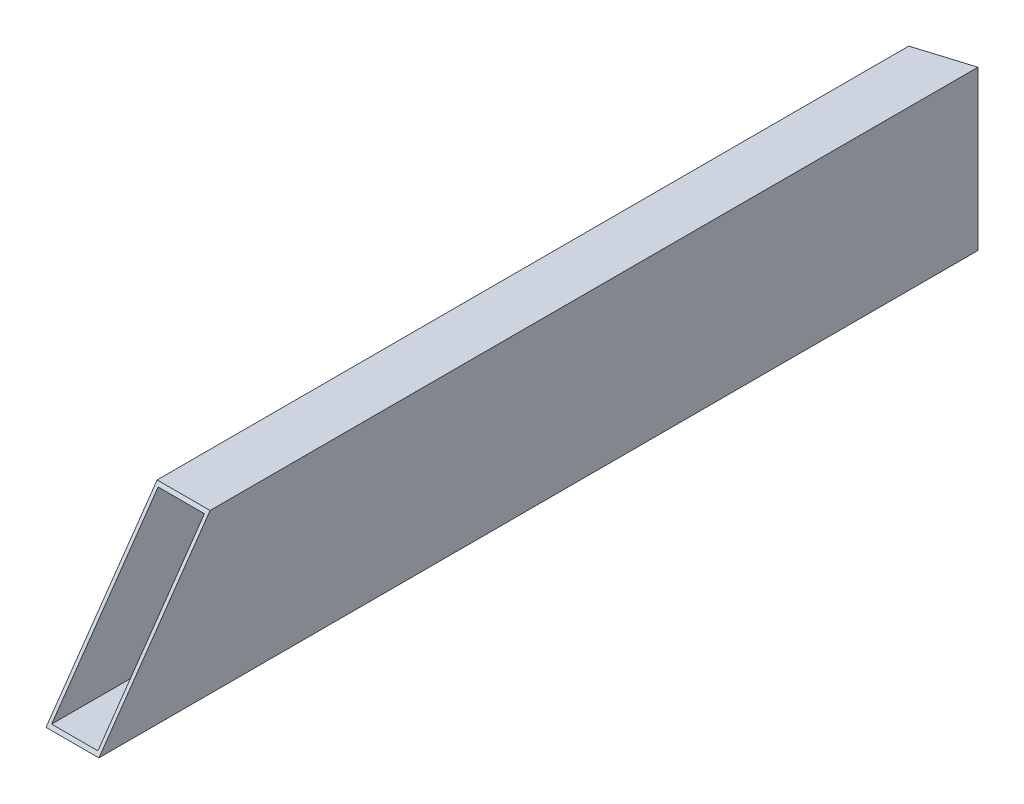
ISO-10303-21;
HEADER;
FILE_DESCRIPTION(('STEP AP214'),'2;1');
FILE_NAME('part.step','',(''),(''),'','','');
FILE_SCHEMA(('AUTOMOTIVE_DESIGN { 1 0 10303 214 1 1 1 1 }'));
ENDSEC;
DATA;
#1=APPLICATION_CONTEXT('core data for automotive mechanical design processes');
#2=APPLICATION_PROTOCOL_DEFINITION('international standard','automotive_design',2000,#1);
#3=PRODUCT_CONTEXT('',#1,'mechanical');
#4=PRODUCT('Part','Part','',(#3));
#5=PRODUCT_RELATED_PRODUCT_CATEGORY('part','',(#4));
#6=PRODUCT_DEFINITION_FORMATION('','',#4);
#7=PRODUCT_DEFINITION_CONTEXT('part definition',#1,'design');
#8=PRODUCT_DEFINITION('design','',#6,#7);
#9=PRODUCT_DEFINITION_SHAPE('','',#8);
#10=(LENGTH_UNIT() NAMED_UNIT(*) SI_UNIT(.MILLI.,.METRE.));
#11=(NAMED_UNIT(*) PLANE_ANGLE_UNIT() SI_UNIT($,.RADIAN.));
#12=(NAMED_UNIT(*) SI_UNIT($,.STERADIAN.) SOLID_ANGLE_UNIT());
#13=UNCERTAINTY_MEASURE_WITH_UNIT(LENGTH_MEASURE(1.E-05),#10,'distance_accuracy_value','');
#14=(GEOMETRIC_REPRESENTATION_CONTEXT(3) GLOBAL_UNCERTAINTY_ASSIGNED_CONTEXT((#13)) GLOBAL_UNIT_ASSIGNED_CONTEXT((#10,
#11,#12)) REPRESENTATION_CONTEXT('',''));
#15=CARTESIAN_POINT('',(0.,0.,0.));
#16=DIRECTION('',(0.,0.,1.));
#17=DIRECTION('',(1.,0.,0.));
#18=AXIS2_PLACEMENT_3D('',#15,#16,#17);
#19=CARTESIAN_POINT('',(165.398672692201,38.1004421670406,222.495695070807));
#20=DIRECTION('',(-0.999999999393182,-3.48372726175517E-05,3.93623097224433E-09));
#21=DIRECTION('',(3.48372726175514E-05,-0.999999999393182,0.));
#22=AXIS2_PLACEMENT_3D('',#19,#20,#21);
#23=PLANE('',#22);
#24=DIRECTION('',(3.48372707337596E-05,-0.999999971842059,-0.000234738672888281));
#25=VECTOR('',#24,1.);
#26=CARTESIAN_POINT('',(165.398667903435,38.1932372043687,-172.816392793576));
#27=LINE('',#26,#25);
#28=CARTESIAN_POINT('',(165.398672692199,38.0557762631937,-172.816425060976));
#29=VERTEX_POINT('',#28);
#30=CARTESIAN_POINT('',(165.40132729239,-38.1442261980139,-172.834312148931));
#31=VERTEX_POINT('',#30);
#32=EDGE_CURVE('E141',#29,#31,#27,.T.);
#33=ORIENTED_EDGE('',*,*,#32,.F.);
#34=DIRECTION('',(0.,-0.000112988955529244,-0.999999993616748));
#35=VECTOR('',#34,1.);
#36=CARTESIAN_POINT('',(165.398672692201,38.1004421670406,222.495695070807));
#37=LINE('',#36,#35);
#38=CARTESIAN_POINT('',(165.398672692201,38.0974281855995,195.820685927171));
#39=VERTEX_POINT('',#38);
#40=EDGE_CURVE('E182',#39,#29,#37,.T.);
#41=ORIENTED_EDGE('',*,*,#40,.F.);
#42=DIRECTION('',(-2.85381520902228E-05,0.81911963874694,-0.573622712769166));
#43=VECTOR('',#42,1.);
#44=CARTESIAN_POINT('',(165.399109295172,25.5657804806881,204.596495237463));
#45=LINE('',#44,#43);
#46=CARTESIAN_POINT('',(165.401327292399,-38.0965433888734,249.178694456995));
#47=VERTEX_POINT('',#46);
#48=EDGE_CURVE('E130',#47,#39,#45,.T.);
#49=ORIENTED_EDGE('',*,*,#48,.F.);
#50=DIRECTION('',(0.,-0.000112988955529244,-0.999999993616748));
#51=VECTOR('',#50,1.);
#52=CARTESIAN_POINT('',(165.401327292391,-38.099557300316,222.504304829213));
#53=LINE('',#52,#51);
#54=EDGE_CURVE('E46',#47,#31,#53,.T.);
#55=ORIENTED_EDGE('',*,*,#54,.T.);
#56=EDGE_LOOP('',(#33,#41,#49,#55));
#57=FACE_BOUND('',#56,.T.);
#58=ADVANCED_FACE('F42',(#57),#23,.F.);
#59=CARTESIAN_POINT('',(139.998672707614,38.0995573003161,222.495695170787));
#60=DIRECTION('',(3.48372728377043E-05,-0.99999999300993,0.000112988955460712));
#61=DIRECTION('',(0.,-0.000112988955529249,-0.999999993616748));
#62=AXIS2_PLACEMENT_3D('',#59,#60,#61);
#63=PLANE('',#62);
#64=DIRECTION('',(0.955609018626309,5.3557652019906E-13,-0.294637749652117));
#65=VECTOR('',#64,1.);
#66=CARTESIAN_POINT('',(30.9001983901309,38.0557762631183,-131.347239413304));
#67=LINE('',#66,#65);
#68=CARTESIAN_POINT('',(139.998672707612,38.0557762631795,-164.984980724692));
#69=VERTEX_POINT('',#68);
#70=EDGE_CURVE('E136',#69,#29,#67,.T.);
#71=ORIENTED_EDGE('',*,*,#70,.F.);
#72=DIRECTION('',(0.,-0.000112988955529244,-0.999999993616748));
#73=VECTOR('',#72,1.);
#74=CARTESIAN_POINT('',(139.998672707614,38.0995573003161,222.495695170787));
#75=LINE('',#74,#73);
#76=CARTESIAN_POINT('',(139.998672707614,38.0965433888735,195.821305543005));
#77=VERTEX_POINT('',#76);
#78=EDGE_CURVE('E180',#77,#69,#75,.T.);
#79=ORIENTED_EDGE('',*,*,#78,.F.);
#80=DIRECTION('',(-0.999999999095737,-3.48345167604918E-05,2.43943241643697E-05));
#81=VECTOR('',#80,1.);
#82=CARTESIAN_POINT('',(139.998022108895,38.0965433662102,195.821305558876));
#83=LINE('',#82,#81);
#84=EDGE_CURVE('E134',#39,#77,#83,.T.);
#85=ORIENTED_EDGE('',*,*,#84,.F.);
#86=ORIENTED_EDGE('',*,*,#40,.T.);
#87=EDGE_LOOP('',(#71,#79,#85,#86));
#88=FACE_BOUND('',#87,.T.);
#89=ADVANCED_FACE('F190',(#88),#63,.F.);
#90=CARTESIAN_POINT('',(139.998672707614,38.0995573003161,222.495695170787));
#91=DIRECTION('',(0.999999999393182,3.48372726175517E-05,-3.93623097224433E-09));
#92=DIRECTION('',(-3.48372726175514E-05,0.999999999393182,0.));
#93=AXIS2_PLACEMENT_3D('',#90,#91,#92);
#94=PLANE('',#93);
#95=DIRECTION('',(-3.48372707337596E-05,0.999999971842059,0.000234738672888281));
#96=VECTOR('',#95,1.);
#97=CARTESIAN_POINT('',(139.998668013717,38.190513994919,-164.984949096535));
#98=LINE('',#97,#96);
#99=CARTESIAN_POINT('',(140.001327307795,-38.1442261980283,-165.002867812645));
#100=VERTEX_POINT('',#99);
#101=EDGE_CURVE('E11',#100,#69,#98,.T.);
#102=ORIENTED_EDGE('',*,*,#101,.F.);
#103=DIRECTION('',(0.,-0.000112988955529244,-0.999999993616748));
#104=VECTOR('',#103,1.);
#105=CARTESIAN_POINT('',(140.001327307804,-38.1004421670406,222.504304929193));
#106=LINE('',#105,#104);
#107=CARTESIAN_POINT('',(140.001327307804,-38.0974281855995,249.179314072829));
#108=VERTEX_POINT('',#107);
#109=EDGE_CURVE('E110',#108,#100,#106,.T.);
#110=ORIENTED_EDGE('',*,*,#109,.F.);
#111=DIRECTION('',(2.85381520902228E-05,-0.81911963874694,0.573622712769166));
#112=VECTOR('',#111,1.);
#113=CARTESIAN_POINT('',(139.999109300445,25.5651867262026,204.596911038822));
#114=LINE('',#113,#112);
#115=EDGE_CURVE('E115',#77,#108,#114,.T.);
#116=ORIENTED_EDGE('',*,*,#115,.F.);
#117=ORIENTED_EDGE('',*,*,#78,.T.);
#118=EDGE_LOOP('',(#102,#110,#116,#117));
#119=FACE_BOUND('',#118,.T.);
#120=ADVANCED_FACE('F112',(#119),#94,.F.);
#121=CARTESIAN_POINT('',(163.811227997335,36.5128868739671,222.495874447022));
#122=DIRECTION('',(-0.999999999393182,-3.48372726173296E-05,3.93623097224433E-09));
#123=DIRECTION('',(3.48372726173294E-05,-0.999999999393182,0.));
#124=AXIS2_PLACEMENT_3D('',#121,#122,#123);
#125=PLANE('',#124);
#126=DIRECTION('',(0.,-0.000112988955529244,-0.999999993616748));
#127=VECTOR('',#126,1.);
#128=CARTESIAN_POINT('',(163.811227997335,36.5128868739671,222.495874447022));
#129=LINE('',#128,#127);
#130=CARTESIAN_POINT('',(163.811227997343,36.5099984780026,196.932349830865));
#131=VERTEX_POINT('',#130);
#132=CARTESIAN_POINT('',(163.811227997333,36.4682762119177,-172.327332437624));
#133=VERTEX_POINT('',#132);
#134=EDGE_CURVE('E158',#131,#133,#129,.T.);
#135=ORIENTED_EDGE('',*,*,#134,.T.);
#136=DIRECTION('',(3.48372707335376E-05,-0.999999971842059,-0.000234738672888212));
#137=VECTOR('',#136,1.);
#138=CARTESIAN_POINT('',(163.811223214492,36.6055671444547,-172.327300210132));
#139=LINE('',#138,#137);
#140=CARTESIAN_POINT('',(163.813771989192,-36.5567261467398,-172.344474230251));
#141=VERTEX_POINT('',#140);
#142=EDGE_CURVE('E77',#133,#141,#139,.T.);
#143=ORIENTED_EDGE('',*,*,#142,.T.);
#144=DIRECTION('',(0.,-0.000112988955529244,-0.999999993616748));
#145=VECTOR('',#144,1.);
#146=CARTESIAN_POINT('',(163.813771989184,-36.5121126155832,222.504125465495));
#147=LINE('',#146,#145);
#148=CARTESIAN_POINT('',(163.813771989192,-36.5092242808674,248.06710800528));
#149=VERTEX_POINT('',#148);
#150=EDGE_CURVE('E162',#149,#141,#147,.T.);
#151=ORIENTED_EDGE('',*,*,#150,.F.);
#152=DIRECTION('',(-2.85381520900409E-05,0.81911963874694,-0.573622712769166));
#153=VECTOR('',#152,1.);
#154=CARTESIAN_POINT('',(163.811646408093,24.5005148875559,205.342491927625));
#155=LINE('',#154,#153);
#156=EDGE_CURVE('E157',#149,#131,#155,.T.);
#157=ORIENTED_EDGE('',*,*,#156,.T.);
#158=EDGE_LOOP('',(#135,#143,#151,#157));
#159=FACE_BOUND('',#158,.T.);
#160=ADVANCED_FACE('F211',(#159),#125,.T.);
#161=CARTESIAN_POINT('',(141.58877200267,-36.512886873967,222.504125552978));
#162=DIRECTION('',(-3.48372728368161E-05,0.99999999300993,-0.000112988955460711));
#163=DIRECTION('',(0.,0.000112988955529249,0.999999993616748));
#164=AXIS2_PLACEMENT_3D('',#161,#162,#163);
#165=PLANE('',#164);
#166=ORIENTED_EDGE('',*,*,#150,.T.);
#167=DIRECTION('',(-0.955609018626309,-5.34729107781046E-13,0.294637749652117));
#168=VECTOR('',#167,1.);
#169=CARTESIAN_POINT('',(32.3451795971214,-36.5567261468133,-131.809475651006));
#170=LINE('',#169,#168);
#171=CARTESIAN_POINT('',(141.588772002669,-36.5567261467522,-165.491960436));
#172=VERTEX_POINT('',#171);
#173=EDGE_CURVE('E62',#141,#172,#170,.T.);
#174=ORIENTED_EDGE('',*,*,#173,.T.);
#175=DIRECTION('',(0.,-0.000112988955529244,-0.999999993616748));
#176=VECTOR('',#175,1.);
#177=CARTESIAN_POINT('',(141.58877200267,-36.512886873967,222.504125552978));
#178=LINE('',#177,#176);
#179=CARTESIAN_POINT('',(141.588772002671,-36.5099984780026,248.067650169135));
#180=VERTEX_POINT('',#179);
#181=EDGE_CURVE('E167',#180,#172,#178,.T.);
#182=ORIENTED_EDGE('',*,*,#181,.F.);
#183=DIRECTION('',(0.999999999095737,3.48345167596037E-05,-2.43943241637476E-05));
#184=VECTOR('',#183,1.);
#185=CARTESIAN_POINT('',(141.58939550696,-36.5099984562831,248.067650153925));
#186=LINE('',#185,#184);
#187=EDGE_CURVE('E161',#180,#149,#186,.T.);
#188=ORIENTED_EDGE('',*,*,#187,.T.);
#189=EDGE_LOOP('',(#166,#174,#182,#188));
#190=FACE_BOUND('',#189,.T.);
#191=ADVANCED_FACE('F209',(#190),#165,.T.);
#192=CARTESIAN_POINT('',(141.586228010821,36.5121126155831,222.495874534505));
#193=DIRECTION('',(0.999999999393182,3.48372726172741E-05,-3.93623097224433E-09));
#194=DIRECTION('',(-3.48372726172739E-05,0.999999999393182,0.));
#195=AXIS2_PLACEMENT_3D('',#192,#193,#194);
#196=PLANE('',#195);
#197=ORIENTED_EDGE('',*,*,#181,.T.);
#198=DIRECTION('',(-3.48372707334821E-05,0.999999971842059,0.000234738672888194));
#199=VECTOR('',#198,1.);
#200=CARTESIAN_POINT('',(141.586223310989,36.6031843361861,-165.474786975221));
#201=LINE('',#200,#199);
#202=CARTESIAN_POINT('',(141.586228010811,36.4682762119051,-165.474818643373));
#203=VERTEX_POINT('',#202);
#204=EDGE_CURVE('E163',#172,#203,#201,.T.);
#205=ORIENTED_EDGE('',*,*,#204,.T.);
#206=DIRECTION('',(0.,-0.000112988955529244,-0.999999993616748));
#207=VECTOR('',#206,1.);
#208=CARTESIAN_POINT('',(141.586228010821,36.5121126155831,222.495874534505));
#209=LINE('',#208,#207);
#210=CARTESIAN_POINT('',(141.586228010821,36.5092242808673,196.93289199472));
#211=VERTEX_POINT('',#210);
#212=EDGE_CURVE('E151',#211,#203,#209,.T.);
#213=ORIENTED_EDGE('',*,*,#212,.F.);
#214=DIRECTION('',(2.85381520899955E-05,-0.81911963874694,0.573622712769166));
#215=VECTOR('',#214,1.);
#216=CARTESIAN_POINT('',(141.586646412707,24.499995352381,205.342855753814));
#217=LINE('',#216,#215);
#218=EDGE_CURVE('E166',#211,#180,#217,.T.);
#219=ORIENTED_EDGE('',*,*,#218,.T.);
#220=EDGE_LOOP('',(#197,#205,#213,#219));
#221=FACE_BOUND('',#220,.T.);
#222=ADVANCED_FACE('F204',(#221),#196,.T.);
#223=CARTESIAN_POINT('',(141.586228010821,36.5121126155831,222.495874534505));
#224=DIRECTION('',(3.48372728404799E-05,-0.99999999300993,0.000112988955460706));
#225=DIRECTION('',(0.,-0.000112988955529249,-0.999999993616748));
#226=AXIS2_PLACEMENT_3D('',#223,#224,#225);
#227=PLANE('',#226);
#228=ORIENTED_EDGE('',*,*,#212,.T.);
#229=DIRECTION('',(0.955609018626309,5.38228912393829E-13,-0.294637749652117));
#230=VECTOR('',#229,1.);
#231=CARTESIAN_POINT('',(32.3497851668416,36.4682762118436,-131.794538243953));
#232=LINE('',#231,#230);
#233=EDGE_CURVE('E72',#203,#133,#232,.T.);
#234=ORIENTED_EDGE('',*,*,#233,.T.);
#235=ORIENTED_EDGE('',*,*,#134,.F.);
#236=DIRECTION('',(-0.999999999095737,-3.48345167632671E-05,2.43943241663134E-05));
#237=VECTOR('',#236,1.);
#238=CARTESIAN_POINT('',(141.585604519753,36.5092242591483,196.932892009929));
#239=LINE('',#238,#237);
#240=EDGE_CURVE('E122',#131,#211,#239,.T.);
#241=ORIENTED_EDGE('',*,*,#240,.T.);
#242=EDGE_LOOP('',(#228,#234,#235,#241));
#243=FACE_BOUND('',#242,.T.);
#244=ADVANCED_FACE('F214',(#243),#227,.T.);
#245=CARTESIAN_POINT('',(140.001327307804,-38.1004421670406,222.504304929193));
#246=DIRECTION('',(-3.48372728407574E-05,0.99999999300993,-0.000112988955460706));
#247=DIRECTION('',(0.,0.000112988955529246,0.999999993616748));
#248=AXIS2_PLACEMENT_3D('',#245,#246,#247);
#249=PLANE('',#248);
#250=DIRECTION('',(-0.955609018626309,-5.38494379295762E-13,0.294637749652117));
#251=VECTOR('',#250,1.);
#252=CARTESIAN_POINT('',(30.8953925782489,-38.1442261980897,-131.362826272837));
#253=LINE('',#252,#251);
#254=EDGE_CURVE('E53',#31,#100,#253,.T.);
#255=ORIENTED_EDGE('',*,*,#254,.F.);
#256=ORIENTED_EDGE('',*,*,#54,.F.);
#257=DIRECTION('',(0.999999999095737,3.48345167635447E-05,-2.43943241665077E-05));
#258=VECTOR('',#257,1.);
#259=CARTESIAN_POINT('',(140.001977921633,-38.0974281629356,249.179314056958));
#260=LINE('',#259,#258);
#261=EDGE_CURVE('E121',#108,#47,#260,.T.);
#262=ORIENTED_EDGE('',*,*,#261,.F.);
#263=ORIENTED_EDGE('',*,*,#109,.T.);
#264=EDGE_LOOP('',(#255,#256,#262,#263));
#265=FACE_BOUND('',#264,.T.);
#266=ADVANCED_FACE('F125',(#265),#249,.F.);
#267=CARTESIAN_POINT('',(152.700000000002,0.,222.5));
#268=DIRECTION('',(0.,0.573622713002752,0.819119639080497));
#269=DIRECTION('',(0.,-0.819119639080496,0.573622713002752));
#270=AXIS2_PLACEMENT_3D('',#267,#268,#269);
#271=PLANE('',#270);
#272=ORIENTED_EDGE('',*,*,#156,.F.);
#273=ORIENTED_EDGE('',*,*,#187,.F.);
#274=ORIENTED_EDGE('',*,*,#218,.F.);
#275=ORIENTED_EDGE('',*,*,#240,.F.);
#276=EDGE_LOOP('',(#272,#273,#274,#275));
#277=FACE_BOUND('',#276,.T.);
#278=ORIENTED_EDGE('',*,*,#261,.T.);
#279=ORIENTED_EDGE('',*,*,#48,.T.);
#280=ORIENTED_EDGE('',*,*,#84,.T.);
#281=ORIENTED_EDGE('',*,*,#115,.T.);
#282=EDGE_LOOP('',(#278,#279,#280,#281));
#283=FACE_BOUND('',#282,.T.);
#284=ADVANCED_FACE('F133',(#277,#283),#271,.T.);
#285=CARTESIAN_POINT('',(152.700000000001,-0.0442249674172054,-168.909646436812));
#286=DIRECTION('',(-0.294637742902095,0.000214054018902856,-0.955608996733725));
#287=DIRECTION('',(-0.955609018626309,0.,0.294637749652117));
#288=AXIS2_PLACEMENT_3D('',#285,#286,#287);
#289=PLANE('',#288);
#290=ORIENTED_EDGE('',*,*,#142,.F.);
#291=ORIENTED_EDGE('',*,*,#233,.F.);
#292=ORIENTED_EDGE('',*,*,#204,.F.);
#293=ORIENTED_EDGE('',*,*,#173,.F.);
#294=EDGE_LOOP('',(#290,#291,#292,#293));
#295=FACE_BOUND('',#294,.T.);
#296=ORIENTED_EDGE('',*,*,#70,.T.);
#297=ORIENTED_EDGE('',*,*,#32,.T.);
#298=ORIENTED_EDGE('',*,*,#254,.T.);
#299=ORIENTED_EDGE('',*,*,#101,.T.);
#300=EDGE_LOOP('',(#296,#297,#298,#299));
#301=FACE_BOUND('',#300,.T.);
#302=ADVANCED_FACE('F44',(#295,#301),#289,.T.);
#303=CLOSED_SHELL('',(#58,#89,#120,#160,#191,#222,#244,#266,#284,#302));
#304=MANIFOLD_SOLID_BREP('B2',#303);
#305=ADVANCED_BREP_SHAPE_REPRESENTATION('',(#18,#304),#14);
#306=SHAPE_DEFINITION_REPRESENTATION(#9,#305);
ENDSEC;
END-ISO-10303-21;
